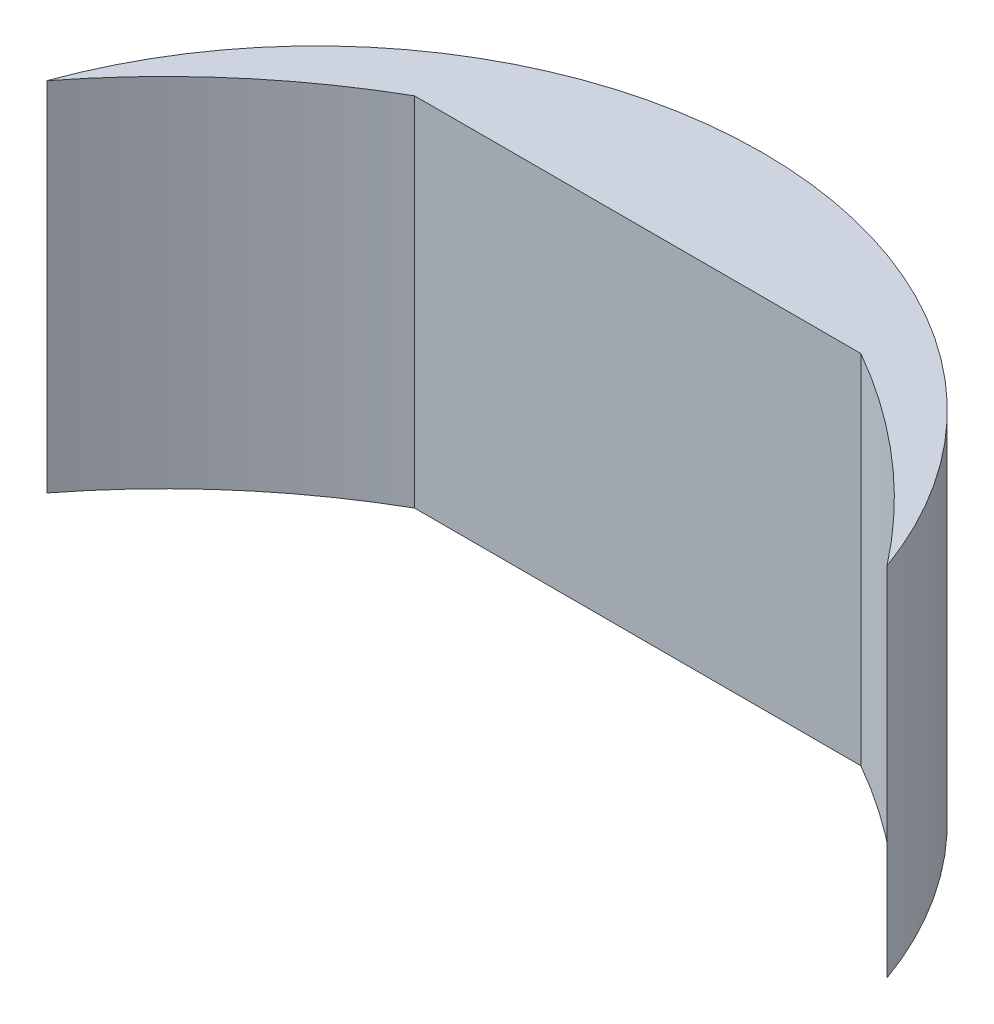
ISO-10303-21;
HEADER;
FILE_DESCRIPTION(('STEP AP214'),'2;1');
FILE_NAME('part.step','',(''),(''),'','','');
FILE_SCHEMA(('AUTOMOTIVE_DESIGN { 1 0 10303 214 1 1 1 1 }'));
ENDSEC;
DATA;
#1=APPLICATION_CONTEXT('core data for automotive mechanical design processes');
#2=APPLICATION_PROTOCOL_DEFINITION('international standard','automotive_design',2000,#1);
#3=PRODUCT_CONTEXT('',#1,'mechanical');
#4=PRODUCT('Part','Part','',(#3));
#5=PRODUCT_RELATED_PRODUCT_CATEGORY('part','',(#4));
#6=PRODUCT_DEFINITION_FORMATION('','',#4);
#7=PRODUCT_DEFINITION_CONTEXT('part definition',#1,'design');
#8=PRODUCT_DEFINITION('design','',#6,#7);
#9=PRODUCT_DEFINITION_SHAPE('','',#8);
#10=(LENGTH_UNIT() NAMED_UNIT(*) SI_UNIT(.MILLI.,.METRE.));
#11=(NAMED_UNIT(*) PLANE_ANGLE_UNIT() SI_UNIT($,.RADIAN.));
#12=(NAMED_UNIT(*) SI_UNIT($,.STERADIAN.) SOLID_ANGLE_UNIT());
#13=UNCERTAINTY_MEASURE_WITH_UNIT(LENGTH_MEASURE(1.E-05),#10,'distance_accuracy_value','');
#14=(GEOMETRIC_REPRESENTATION_CONTEXT(3) GLOBAL_UNCERTAINTY_ASSIGNED_CONTEXT((#13)) GLOBAL_UNIT_ASSIGNED_CONTEXT((#10,
#11,#12)) REPRESENTATION_CONTEXT('',''));
#15=CARTESIAN_POINT('',(0.,0.,0.));
#16=DIRECTION('',(0.,0.,1.));
#17=DIRECTION('',(1.,0.,0.));
#18=AXIS2_PLACEMENT_3D('',#15,#16,#17);
#19=CARTESIAN_POINT('',(94.3922644186341,101.6,165.470089194158));
#20=DIRECTION('',(0.,-1.,0.));
#21=DIRECTION('',(0.,0.,-1.));
#22=AXIS2_PLACEMENT_3D('',#19,#20,#21);
#23=CYLINDRICAL_SURFACE('',#22,190.5);
#24=CARTESIAN_POINT('',(94.3922644186341,0.,165.470089194158));
#25=DIRECTION('',(0.,-1.,0.));
#26=DIRECTION('',(0.,0.,1.));
#27=AXIS2_PLACEMENT_3D('',#24,#25,#26);
#28=CIRCLE('',#27,190.5);
#29=CARTESIAN_POINT('',(-56.0311904251213,0.,48.5811066813966));
#30=VERTEX_POINT('',#29);
#31=CARTESIAN_POINT('',(0.,0.,0.));
#32=VERTEX_POINT('',#31);
#33=EDGE_CURVE('E107',#30,#32,#28,.T.);
#34=ORIENTED_EDGE('',*,*,#33,.T.);
#35=DIRECTION('',(0.,-1.,0.));
#36=VECTOR('',#35,1.);
#37=CARTESIAN_POINT('',(0.,101.6,0.));
#38=LINE('',#37,#36);
#39=CARTESIAN_POINT('',(0.,101.6,0.));
#40=VERTEX_POINT('',#39);
#41=EDGE_CURVE('E11',#40,#32,#38,.T.);
#42=ORIENTED_EDGE('',*,*,#41,.F.);
#43=CARTESIAN_POINT('',(94.3922644186341,101.6,165.470089194158));
#44=DIRECTION('',(0.,-1.,0.));
#45=DIRECTION('',(0.,0.,1.));
#46=AXIS2_PLACEMENT_3D('',#43,#44,#45);
#47=CIRCLE('',#46,190.5);
#48=CARTESIAN_POINT('',(-56.0311904251213,101.6,48.5811066813966));
#49=VERTEX_POINT('',#48);
#50=EDGE_CURVE('E91',#49,#40,#47,.T.);
#51=ORIENTED_EDGE('',*,*,#50,.F.);
#52=DIRECTION('',(0.,-1.,0.));
#53=VECTOR('',#52,1.);
#54=CARTESIAN_POINT('',(-56.0311904251213,101.6,48.5811066813966));
#55=LINE('',#54,#53);
#56=EDGE_CURVE('E103',#49,#30,#55,.T.);
#57=ORIENTED_EDGE('',*,*,#56,.T.);
#58=EDGE_LOOP('',(#34,#42,#51,#57));
#59=FACE_BOUND('',#58,.T.);
#60=ADVANCED_FACE('F39',(#59),#23,.F.);
#61=CARTESIAN_POINT('',(0.,101.6,0.));
#62=DIRECTION('',(0.,0.,-1.));
#63=DIRECTION('',(-1.,0.,0.));
#64=AXIS2_PLACEMENT_3D('',#61,#62,#63);
#65=PLANE('',#64);
#66=DIRECTION('',(1.,0.,0.));
#67=VECTOR('',#66,1.);
#68=CARTESIAN_POINT('',(0.,0.,0.));
#69=LINE('',#68,#67);
#70=CARTESIAN_POINT('',(127.,0.,0.));
#71=VERTEX_POINT('',#70);
#72=EDGE_CURVE('E96',#32,#71,#69,.T.);
#73=ORIENTED_EDGE('',*,*,#72,.T.);
#74=DIRECTION('',(0.,-1.,0.));
#75=VECTOR('',#74,1.);
#76=CARTESIAN_POINT('',(127.,101.6,0.));
#77=LINE('',#76,#75);
#78=CARTESIAN_POINT('',(127.,101.6,0.));
#79=VERTEX_POINT('',#78);
#80=EDGE_CURVE('E48',#79,#71,#77,.T.);
#81=ORIENTED_EDGE('',*,*,#80,.F.);
#82=DIRECTION('',(1.,0.,0.));
#83=VECTOR('',#82,1.);
#84=CARTESIAN_POINT('',(0.,101.6,0.));
#85=LINE('',#84,#83);
#86=EDGE_CURVE('E86',#40,#79,#85,.T.);
#87=ORIENTED_EDGE('',*,*,#86,.F.);
#88=ORIENTED_EDGE('',*,*,#41,.T.);
#89=EDGE_LOOP('',(#73,#81,#87,#88));
#90=FACE_BOUND('',#89,.T.);
#91=ADVANCED_FACE('F95',(#90),#65,.F.);
#92=CARTESIAN_POINT('',(32.6077355813659,101.6,165.470089194158));
#93=DIRECTION('',(0.,-1.,0.));
#94=DIRECTION('',(0.,0.,-1.));
#95=AXIS2_PLACEMENT_3D('',#92,#93,#94);
#96=CYLINDRICAL_SURFACE('',#95,190.5);
#97=CARTESIAN_POINT('',(32.6077355813659,0.,165.470089194158));
#98=DIRECTION('',(0.,-1.,0.));
#99=DIRECTION('',(0.,0.,-1.));
#100=AXIS2_PLACEMENT_3D('',#97,#98,#99);
#101=CIRCLE('',#100,190.5);
#102=CARTESIAN_POINT('',(183.031190425121,0.,48.5811066813966));
#103=VERTEX_POINT('',#102);
#104=EDGE_CURVE('E73',#71,#103,#101,.T.);
#105=ORIENTED_EDGE('',*,*,#104,.T.);
#106=DIRECTION('',(0.,-1.,0.));
#107=VECTOR('',#106,1.);
#108=CARTESIAN_POINT('',(183.031190425121,101.6,48.5811066813966));
#109=LINE('',#108,#107);
#110=CARTESIAN_POINT('',(183.031190425121,101.6,48.5811066813966));
#111=VERTEX_POINT('',#110);
#112=EDGE_CURVE('E98',#111,#103,#109,.T.);
#113=ORIENTED_EDGE('',*,*,#112,.F.);
#114=CARTESIAN_POINT('',(32.6077355813659,101.6,165.470089194158));
#115=DIRECTION('',(0.,-1.,0.));
#116=DIRECTION('',(0.,0.,-1.));
#117=AXIS2_PLACEMENT_3D('',#114,#115,#116);
#118=CIRCLE('',#117,190.5);
#119=EDGE_CURVE('E89',#79,#111,#118,.T.);
#120=ORIENTED_EDGE('',*,*,#119,.F.);
#121=ORIENTED_EDGE('',*,*,#80,.T.);
#122=EDGE_LOOP('',(#105,#113,#120,#121));
#123=FACE_BOUND('',#122,.T.);
#124=ADVANCED_FACE('F99',(#123),#96,.F.);
#125=CARTESIAN_POINT('',(63.5,101.6,91.4914144821266));
#126=DIRECTION('',(0.,-1.,0.));
#127=DIRECTION('',(0.,0.,-1.));
#128=AXIS2_PLACEMENT_3D('',#125,#126,#127);
#129=CYLINDRICAL_SURFACE('',#128,127.);
#130=CARTESIAN_POINT('',(63.5,0.,91.4914144821266));
#131=DIRECTION('',(0.,1.,0.));
#132=DIRECTION('',(0.,0.,-1.));
#133=AXIS2_PLACEMENT_3D('',#130,#131,#132);
#134=CIRCLE('',#133,127.);
#135=EDGE_CURVE('E79',#103,#30,#134,.T.);
#136=ORIENTED_EDGE('',*,*,#135,.T.);
#137=ORIENTED_EDGE('',*,*,#56,.F.);
#138=CARTESIAN_POINT('',(63.5,101.6,91.4914144821266));
#139=DIRECTION('',(0.,1.,0.));
#140=DIRECTION('',(0.,0.,-1.));
#141=AXIS2_PLACEMENT_3D('',#138,#139,#140);
#142=CIRCLE('',#141,127.);
#143=EDGE_CURVE('E56',#111,#49,#142,.T.);
#144=ORIENTED_EDGE('',*,*,#143,.F.);
#145=ORIENTED_EDGE('',*,*,#112,.T.);
#146=EDGE_LOOP('',(#136,#137,#144,#145));
#147=FACE_BOUND('',#146,.T.);
#148=ADVANCED_FACE('F120',(#147),#129,.T.);
#149=CARTESIAN_POINT('',(94.3922644186341,101.6,165.470089194158));
#150=DIRECTION('',(0.,1.,0.));
#151=DIRECTION('',(0.,0.,1.));
#152=AXIS2_PLACEMENT_3D('',#149,#150,#151);
#153=PLANE('',#152);
#154=ORIENTED_EDGE('',*,*,#50,.T.);
#155=ORIENTED_EDGE('',*,*,#86,.T.);
#156=ORIENTED_EDGE('',*,*,#119,.T.);
#157=ORIENTED_EDGE('',*,*,#143,.T.);
#158=EDGE_LOOP('',(#154,#155,#156,#157));
#159=FACE_BOUND('',#158,.T.);
#160=ADVANCED_FACE('F87',(#159),#153,.T.);
#161=CARTESIAN_POINT('',(94.3922644186341,0.,165.470089194158));
#162=DIRECTION('',(0.,1.,0.));
#163=DIRECTION('',(0.,0.,1.));
#164=AXIS2_PLACEMENT_3D('',#161,#162,#163);
#165=PLANE('',#164);
#166=ORIENTED_EDGE('',*,*,#33,.F.);
#167=ORIENTED_EDGE('',*,*,#135,.F.);
#168=ORIENTED_EDGE('',*,*,#104,.F.);
#169=ORIENTED_EDGE('',*,*,#72,.F.);
#170=EDGE_LOOP('',(#166,#167,#168,#169));
#171=FACE_BOUND('',#170,.T.);
#172=ADVANCED_FACE('F123',(#171),#165,.F.);
#173=CLOSED_SHELL('',(#60,#91,#124,#148,#160,#172));
#174=MANIFOLD_SOLID_BREP('B2',#173);
#175=ADVANCED_BREP_SHAPE_REPRESENTATION('',(#18,#174),#14);
#176=SHAPE_DEFINITION_REPRESENTATION(#9,#175);
ENDSEC;
END-ISO-10303-21;
